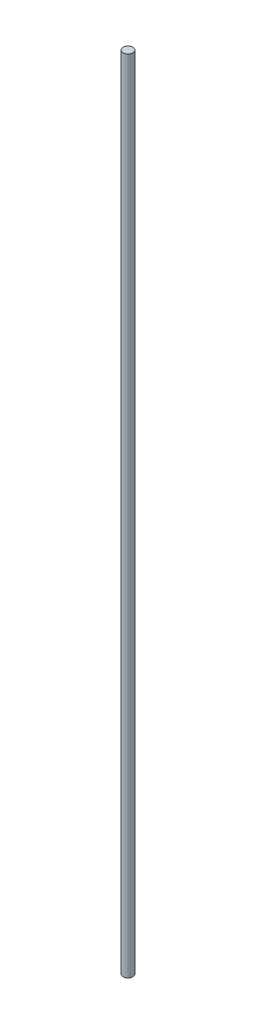
ISO-10303-21;
HEADER;
FILE_DESCRIPTION(('STEP AP214'),'2;1');
FILE_NAME('part.step','',(''),(''),'','','');
FILE_SCHEMA(('AUTOMOTIVE_DESIGN { 1 0 10303 214 1 1 1 1 }'));
ENDSEC;
DATA;
#1=APPLICATION_CONTEXT('core data for automotive mechanical design processes');
#2=APPLICATION_PROTOCOL_DEFINITION('international standard','automotive_design',2000,#1);
#3=PRODUCT_CONTEXT('',#1,'mechanical');
#4=PRODUCT('Part','Part','',(#3));
#5=PRODUCT_RELATED_PRODUCT_CATEGORY('part','',(#4));
#6=PRODUCT_DEFINITION_FORMATION('','',#4);
#7=PRODUCT_DEFINITION_CONTEXT('part definition',#1,'design');
#8=PRODUCT_DEFINITION('design','',#6,#7);
#9=PRODUCT_DEFINITION_SHAPE('','',#8);
#10=(LENGTH_UNIT() NAMED_UNIT(*) SI_UNIT(.MILLI.,.METRE.));
#11=(NAMED_UNIT(*) PLANE_ANGLE_UNIT() SI_UNIT($,.RADIAN.));
#12=(NAMED_UNIT(*) SI_UNIT($,.STERADIAN.) SOLID_ANGLE_UNIT());
#13=UNCERTAINTY_MEASURE_WITH_UNIT(LENGTH_MEASURE(1.E-05),#10,'distance_accuracy_value','');
#14=(GEOMETRIC_REPRESENTATION_CONTEXT(3) GLOBAL_UNCERTAINTY_ASSIGNED_CONTEXT((#13)) GLOBAL_UNIT_ASSIGNED_CONTEXT((#10,
#11,#12)) REPRESENTATION_CONTEXT('',''));
#15=CARTESIAN_POINT('',(0.,0.,0.));
#16=DIRECTION('',(0.,0.,1.));
#17=DIRECTION('',(1.,0.,0.));
#18=AXIS2_PLACEMENT_3D('',#15,#16,#17);
#19=CARTESIAN_POINT('',(0.,245.,0.));
#20=DIRECTION('',(0.,-1.,0.));
#21=DIRECTION('',(0.,0.,-1.));
#22=AXIS2_PLACEMENT_3D('',#19,#20,#21);
#23=CYLINDRICAL_SURFACE('',#22,1.5);
#24=CARTESIAN_POINT('',(0.,245.,0.));
#25=DIRECTION('',(0.,1.,0.));
#26=DIRECTION('',(0.,0.,1.));
#27=AXIS2_PLACEMENT_3D('',#24,#25,#26);
#28=CIRCLE('',#27,1.5);
#29=CARTESIAN_POINT('',(0.,245.,1.5));
#30=VERTEX_POINT('',#29);
#31=EDGE_CURVE('E10',#30,#30,#28,.T.);
#32=ORIENTED_EDGE('',*,*,#31,.F.);
#33=EDGE_LOOP('',(#32));
#34=FACE_BOUND('',#33,.T.);
#35=CARTESIAN_POINT('',(0.,0.,0.));
#36=DIRECTION('',(0.,1.,0.));
#37=DIRECTION('',(0.,0.,1.));
#38=AXIS2_PLACEMENT_3D('',#35,#36,#37);
#39=CIRCLE('',#38,1.5);
#40=CARTESIAN_POINT('',(0.,0.,1.5));
#41=VERTEX_POINT('',#40);
#42=EDGE_CURVE('E42',#41,#41,#39,.T.);
#43=ORIENTED_EDGE('',*,*,#42,.T.);
#44=EDGE_LOOP('',(#43));
#45=FACE_BOUND('',#44,.T.);
#46=ADVANCED_FACE('F39',(#34,#45),#23,.T.);
#47=CARTESIAN_POINT('',(0.,245.,0.));
#48=DIRECTION('',(0.,1.,0.));
#49=DIRECTION('',(0.,0.,1.));
#50=AXIS2_PLACEMENT_3D('',#47,#48,#49);
#51=PLANE('',#50);
#52=ORIENTED_EDGE('',*,*,#31,.T.);
#53=EDGE_LOOP('',(#52));
#54=FACE_BOUND('',#53,.T.);
#55=ADVANCED_FACE('F56',(#54),#51,.T.);
#56=CARTESIAN_POINT('',(0.,0.,0.));
#57=DIRECTION('',(0.,1.,0.));
#58=DIRECTION('',(0.,0.,1.));
#59=AXIS2_PLACEMENT_3D('',#56,#57,#58);
#60=PLANE('',#59);
#61=ORIENTED_EDGE('',*,*,#42,.F.);
#62=EDGE_LOOP('',(#61));
#63=FACE_BOUND('',#62,.T.);
#64=ADVANCED_FACE('F54',(#63),#60,.F.);
#65=CLOSED_SHELL('',(#46,#55,#64));
#66=MANIFOLD_SOLID_BREP('B2',#65);
#67=ADVANCED_BREP_SHAPE_REPRESENTATION('',(#18,#66),#14);
#68=SHAPE_DEFINITION_REPRESENTATION(#9,#67);
ENDSEC;
END-ISO-10303-21;
